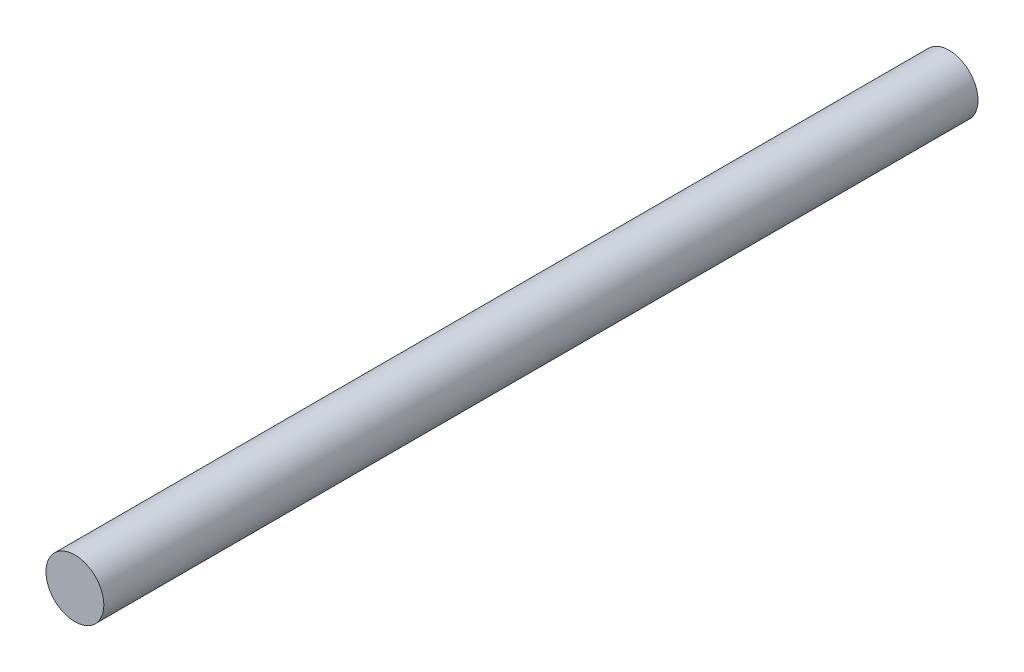
ISO-10303-21;
HEADER;
FILE_DESCRIPTION(('STEP AP214'),'2;1');
FILE_NAME('part.step','',(''),(''),'','','');
FILE_SCHEMA(('AUTOMOTIVE_DESIGN { 1 0 10303 214 1 1 1 1 }'));
ENDSEC;
DATA;
#1=APPLICATION_CONTEXT('core data for automotive mechanical design processes');
#2=APPLICATION_PROTOCOL_DEFINITION('international standard','automotive_design',2000,#1);
#3=PRODUCT_CONTEXT('',#1,'mechanical');
#4=PRODUCT('Part','Part','',(#3));
#5=PRODUCT_RELATED_PRODUCT_CATEGORY('part','',(#4));
#6=PRODUCT_DEFINITION_FORMATION('','',#4);
#7=PRODUCT_DEFINITION_CONTEXT('part definition',#1,'design');
#8=PRODUCT_DEFINITION('design','',#6,#7);
#9=PRODUCT_DEFINITION_SHAPE('','',#8);
#10=(LENGTH_UNIT() NAMED_UNIT(*) SI_UNIT(.MILLI.,.METRE.));
#11=(NAMED_UNIT(*) PLANE_ANGLE_UNIT() SI_UNIT($,.RADIAN.));
#12=(NAMED_UNIT(*) SI_UNIT($,.STERADIAN.) SOLID_ANGLE_UNIT());
#13=UNCERTAINTY_MEASURE_WITH_UNIT(LENGTH_MEASURE(1.E-05),#10,'distance_accuracy_value','');
#14=(GEOMETRIC_REPRESENTATION_CONTEXT(3) GLOBAL_UNCERTAINTY_ASSIGNED_CONTEXT((#13)) GLOBAL_UNIT_ASSIGNED_CONTEXT((#10,
#11,#12)) REPRESENTATION_CONTEXT('',''));
#15=CARTESIAN_POINT('',(0.,0.,0.));
#16=DIRECTION('',(0.,0.,1.));
#17=DIRECTION('',(1.,0.,0.));
#18=AXIS2_PLACEMENT_3D('',#15,#16,#17);
#19=CARTESIAN_POINT('',(0.,0.,-190.14213562373));
#20=DIRECTION('',(0.,0.,1.));
#21=DIRECTION('',(1.,0.,0.));
#22=AXIS2_PLACEMENT_3D('',#19,#20,#21);
#23=CYLINDRICAL_SURFACE('',#22,5.);
#24=CARTESIAN_POINT('',(0.,0.,-126.));
#25=DIRECTION('',(0.,0.,1.));
#26=DIRECTION('',(0.,-1.,0.));
#27=AXIS2_PLACEMENT_3D('',#24,#25,#26);
#28=CIRCLE('',#27,5.);
#29=CARTESIAN_POINT('',(0.,-5.,-126.));
#30=VERTEX_POINT('',#29);
#31=EDGE_CURVE('E10',#30,#30,#28,.F.);
#32=ORIENTED_EDGE('',*,*,#31,.F.);
#33=EDGE_LOOP('',(#32));
#34=FACE_BOUND('',#33,.T.);
#35=CARTESIAN_POINT('',(0.,0.,25.));
#36=DIRECTION('',(0.,0.,1.));
#37=DIRECTION('',(1.,0.,0.));
#38=AXIS2_PLACEMENT_3D('',#35,#36,#37);
#39=CIRCLE('',#38,5.);
#40=CARTESIAN_POINT('',(5.,0.,25.));
#41=VERTEX_POINT('',#40);
#42=EDGE_CURVE('E42',#41,#41,#39,.T.);
#43=ORIENTED_EDGE('',*,*,#42,.F.);
#44=EDGE_LOOP('',(#43));
#45=FACE_BOUND('',#44,.T.);
#46=ADVANCED_FACE('F36',(#34,#45),#23,.T.);
#47=CARTESIAN_POINT('',(0.,1.22124532708767E-13,-126.));
#48=DIRECTION('',(0.,0.,1.));
#49=DIRECTION('',(1.,0.,0.));
#50=AXIS2_PLACEMENT_3D('',#47,#48,#49);
#51=PLANE('',#50);
#52=ORIENTED_EDGE('',*,*,#31,.T.);
#53=EDGE_LOOP('',(#52));
#54=FACE_BOUND('',#53,.T.);
#55=ADVANCED_FACE('F51',(#54),#51,.F.);
#56=CARTESIAN_POINT('',(0.,0.,25.));
#57=DIRECTION('',(0.,0.,1.));
#58=DIRECTION('',(1.,0.,0.));
#59=AXIS2_PLACEMENT_3D('',#56,#57,#58);
#60=PLANE('',#59);
#61=ORIENTED_EDGE('',*,*,#42,.T.);
#62=EDGE_LOOP('',(#61));
#63=FACE_BOUND('',#62,.T.);
#64=ADVANCED_FACE('F48',(#63),#60,.T.);
#65=CLOSED_SHELL('',(#46,#55,#64));
#66=MANIFOLD_SOLID_BREP('B2',#65);
#67=ADVANCED_BREP_SHAPE_REPRESENTATION('',(#18,#66),#14);
#68=SHAPE_DEFINITION_REPRESENTATION(#9,#67);
ENDSEC;
END-ISO-10303-21;
